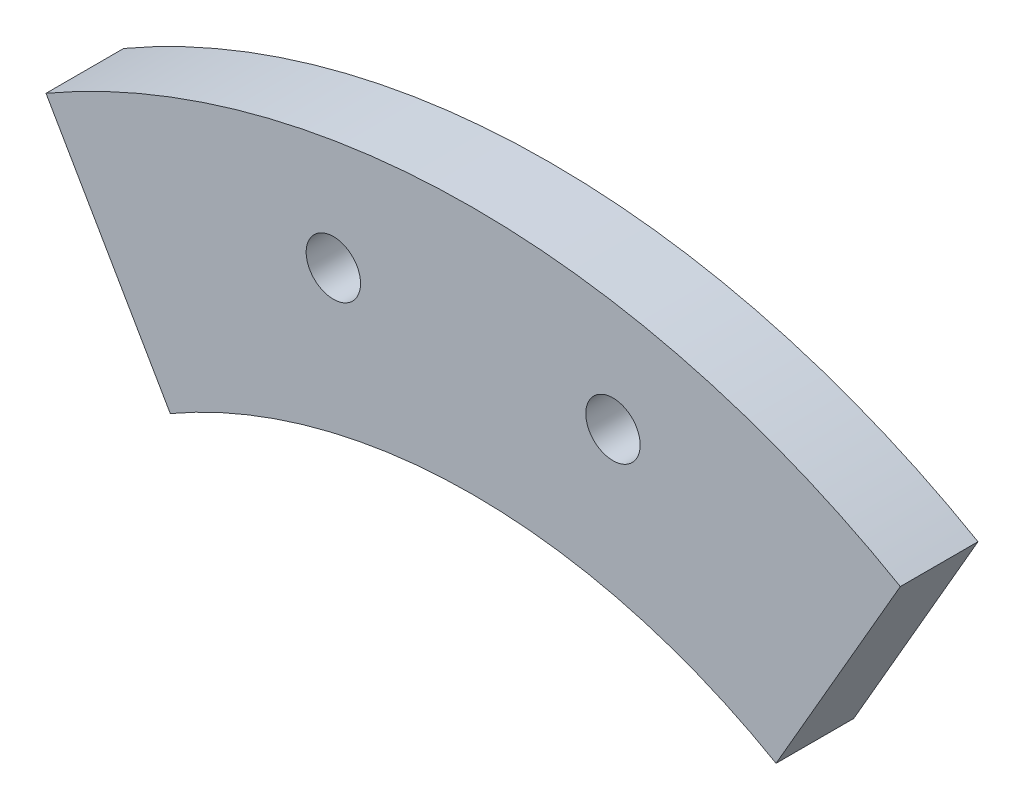
ISO-10303-21;
HEADER;
FILE_DESCRIPTION(('STEP AP214'),'2;1');
FILE_NAME('part.step','',(''),(''),'','','');
FILE_SCHEMA(('AUTOMOTIVE_DESIGN { 1 0 10303 214 1 1 1 1 }'));
ENDSEC;
DATA;
#1=APPLICATION_CONTEXT('core data for automotive mechanical design processes');
#2=APPLICATION_PROTOCOL_DEFINITION('international standard','automotive_design',2000,#1);
#3=PRODUCT_CONTEXT('',#1,'mechanical');
#4=PRODUCT('Part','Part','',(#3));
#5=PRODUCT_RELATED_PRODUCT_CATEGORY('part','',(#4));
#6=PRODUCT_DEFINITION_FORMATION('','',#4);
#7=PRODUCT_DEFINITION_CONTEXT('part definition',#1,'design');
#8=PRODUCT_DEFINITION('design','',#6,#7);
#9=PRODUCT_DEFINITION_SHAPE('','',#8);
#10=(LENGTH_UNIT() NAMED_UNIT(*) SI_UNIT(.MILLI.,.METRE.));
#11=(NAMED_UNIT(*) PLANE_ANGLE_UNIT() SI_UNIT($,.RADIAN.));
#12=(NAMED_UNIT(*) SI_UNIT($,.STERADIAN.) SOLID_ANGLE_UNIT());
#13=UNCERTAINTY_MEASURE_WITH_UNIT(LENGTH_MEASURE(1.E-05),#10,'distance_accuracy_value','');
#14=(GEOMETRIC_REPRESENTATION_CONTEXT(3) GLOBAL_UNCERTAINTY_ASSIGNED_CONTEXT((#13)) GLOBAL_UNIT_ASSIGNED_CONTEXT((#10,
#11,#12)) REPRESENTATION_CONTEXT('',''));
#15=CARTESIAN_POINT('',(0.,0.,0.));
#16=DIRECTION('',(0.,0.,1.));
#17=DIRECTION('',(1.,0.,0.));
#18=AXIS2_PLACEMENT_3D('',#15,#16,#17);
#19=CARTESIAN_POINT('',(0.,0.,5.));
#20=DIRECTION('',(-0.866025403784438,0.500000000000001,0.));
#21=DIRECTION('',(-0.500000000000001,-0.866025403784438,0.));
#22=AXIS2_PLACEMENT_3D('',#19,#20,#21);
#23=PLANE('',#22);
#24=DIRECTION('',(0.500000000000001,0.866025403784438,0.));
#25=VECTOR('',#24,1.);
#26=CARTESIAN_POINT('',(0.,0.,5.));
#27=LINE('',#26,#25);
#28=CARTESIAN_POINT('',(19.5,33.7749907475931,5.));
#29=VERTEX_POINT('',#28);
#30=CARTESIAN_POINT('',(27.5000000000001,47.6313972081441,5.));
#31=VERTEX_POINT('',#30);
#32=EDGE_CURVE('E111',#29,#31,#27,.T.);
#33=ORIENTED_EDGE('',*,*,#32,.F.);
#34=DIRECTION('',(0.,0.,-1.));
#35=VECTOR('',#34,1.);
#36=CARTESIAN_POINT('',(19.5,33.7749907475931,5.));
#37=LINE('',#36,#35);
#38=CARTESIAN_POINT('',(19.5,33.7749907475931,0.));
#39=VERTEX_POINT('',#38);
#40=EDGE_CURVE('E107',#29,#39,#37,.T.);
#41=ORIENTED_EDGE('',*,*,#40,.T.);
#42=DIRECTION('',(0.500000000000001,0.866025403784438,0.));
#43=VECTOR('',#42,1.);
#44=CARTESIAN_POINT('',(0.,0.,0.));
#45=LINE('',#44,#43);
#46=CARTESIAN_POINT('',(27.5000000000001,47.6313972081441,0.));
#47=VERTEX_POINT('',#46);
#48=EDGE_CURVE('E97',#39,#47,#45,.T.);
#49=ORIENTED_EDGE('',*,*,#48,.T.);
#50=DIRECTION('',(0.,0.,-1.));
#51=VECTOR('',#50,1.);
#52=CARTESIAN_POINT('',(27.5000000000001,47.6313972081441,5.));
#53=LINE('',#52,#51);
#54=EDGE_CURVE('E13',#31,#47,#53,.T.);
#55=ORIENTED_EDGE('',*,*,#54,.F.);
#56=EDGE_LOOP('',(#33,#41,#49,#55));
#57=FACE_BOUND('',#56,.T.);
#58=ADVANCED_FACE('F46',(#57),#23,.F.);
#59=CARTESIAN_POINT('',(0.,0.,5.));
#60=DIRECTION('',(0.,0.,-1.));
#61=DIRECTION('',(-1.,0.,0.));
#62=AXIS2_PLACEMENT_3D('',#59,#60,#61);
#63=CYLINDRICAL_SURFACE('',#62,55.);
#64=CARTESIAN_POINT('',(0.,0.,0.));
#65=DIRECTION('',(0.,0.,1.));
#66=DIRECTION('',(1.,0.,0.));
#67=AXIS2_PLACEMENT_3D('',#64,#65,#66);
#68=CIRCLE('',#67,55.);
#69=CARTESIAN_POINT('',(-27.5000000000001,47.6313972081441,0.));
#70=VERTEX_POINT('',#69);
#71=EDGE_CURVE('E87',#47,#70,#68,.T.);
#72=ORIENTED_EDGE('',*,*,#71,.T.);
#73=DIRECTION('',(0.,0.,-1.));
#74=VECTOR('',#73,1.);
#75=CARTESIAN_POINT('',(-27.5000000000001,47.6313972081441,5.));
#76=LINE('',#75,#74);
#77=CARTESIAN_POINT('',(-27.5000000000001,47.6313972081441,5.));
#78=VERTEX_POINT('',#77);
#79=EDGE_CURVE('E54',#78,#70,#76,.T.);
#80=ORIENTED_EDGE('',*,*,#79,.F.);
#81=CARTESIAN_POINT('',(0.,0.,5.));
#82=DIRECTION('',(0.,0.,1.));
#83=DIRECTION('',(1.,0.,0.));
#84=AXIS2_PLACEMENT_3D('',#81,#82,#83);
#85=CIRCLE('',#84,55.);
#86=EDGE_CURVE('E109',#31,#78,#85,.T.);
#87=ORIENTED_EDGE('',*,*,#86,.F.);
#88=ORIENTED_EDGE('',*,*,#54,.T.);
#89=EDGE_LOOP('',(#72,#80,#87,#88));
#90=FACE_BOUND('',#89,.T.);
#91=ADVANCED_FACE('F95',(#90),#63,.T.);
#92=CARTESIAN_POINT('',(-9.,47.1487009365051,5.));
#93=DIRECTION('',(0.,0.,-1.));
#94=DIRECTION('',(-1.,0.,0.));
#95=AXIS2_PLACEMENT_3D('',#92,#93,#94);
#96=CYLINDRICAL_SURFACE('',#95,1.75);
#97=CARTESIAN_POINT('',(-9.,47.1487009365051,5.));
#98=DIRECTION('',(0.,0.,1.));
#99=DIRECTION('',(1.,0.,0.));
#100=AXIS2_PLACEMENT_3D('',#97,#98,#99);
#101=CIRCLE('',#100,1.75);
#102=CARTESIAN_POINT('',(-7.25,47.1487009365051,5.));
#103=VERTEX_POINT('',#102);
#104=EDGE_CURVE('E113',#103,#103,#101,.T.);
#105=ORIENTED_EDGE('',*,*,#104,.T.);
#106=EDGE_LOOP('',(#105));
#107=FACE_BOUND('',#106,.T.);
#108=CARTESIAN_POINT('',(-9.,47.1487009365051,0.));
#109=DIRECTION('',(0.,0.,1.));
#110=DIRECTION('',(1.,0.,0.));
#111=AXIS2_PLACEMENT_3D('',#108,#109,#110);
#112=CIRCLE('',#111,1.75);
#113=CARTESIAN_POINT('',(-7.25,47.1487009365051,0.));
#114=VERTEX_POINT('',#113);
#115=EDGE_CURVE('E99',#114,#114,#112,.T.);
#116=ORIENTED_EDGE('',*,*,#115,.F.);
#117=EDGE_LOOP('',(#116));
#118=FACE_BOUND('',#117,.T.);
#119=ADVANCED_FACE('F148',(#107,#118),#96,.F.);
#120=CARTESIAN_POINT('',(9.,47.1487009365051,5.));
#121=DIRECTION('',(0.,0.,-1.));
#122=DIRECTION('',(-1.,0.,0.));
#123=AXIS2_PLACEMENT_3D('',#120,#121,#122);
#124=CYLINDRICAL_SURFACE('',#123,1.75);
#125=CARTESIAN_POINT('',(9.,47.1487009365051,5.));
#126=DIRECTION('',(0.,0.,1.));
#127=DIRECTION('',(1.,0.,0.));
#128=AXIS2_PLACEMENT_3D('',#125,#126,#127);
#129=CIRCLE('',#128,1.75);
#130=CARTESIAN_POINT('',(10.75,47.1487009365051,5.));
#131=VERTEX_POINT('',#130);
#132=EDGE_CURVE('E89',#131,#131,#129,.T.);
#133=ORIENTED_EDGE('',*,*,#132,.T.);
#134=EDGE_LOOP('',(#133));
#135=FACE_BOUND('',#134,.T.);
#136=CARTESIAN_POINT('',(9.,47.1487009365051,0.));
#137=DIRECTION('',(0.,0.,1.));
#138=DIRECTION('',(1.,0.,0.));
#139=AXIS2_PLACEMENT_3D('',#136,#137,#138);
#140=CIRCLE('',#139,1.75);
#141=CARTESIAN_POINT('',(10.75,47.1487009365051,0.));
#142=VERTEX_POINT('',#141);
#143=EDGE_CURVE('E104',#142,#142,#140,.T.);
#144=ORIENTED_EDGE('',*,*,#143,.F.);
#145=EDGE_LOOP('',(#144));
#146=FACE_BOUND('',#145,.T.);
#147=ADVANCED_FACE('F48',(#135,#146),#124,.F.);
#148=CARTESIAN_POINT('',(0.,0.,5.));
#149=DIRECTION('',(-0.866025403784438,-0.500000000000001,0.));
#150=DIRECTION('',(0.500000000000001,-0.866025403784438,0.));
#151=AXIS2_PLACEMENT_3D('',#148,#149,#150);
#152=PLANE('',#151);
#153=DIRECTION('',(0.,0.,-1.));
#154=VECTOR('',#153,1.);
#155=CARTESIAN_POINT('',(-19.5000000000001,33.7749907475931,5.));
#156=LINE('',#155,#154);
#157=CARTESIAN_POINT('',(-19.5,33.7749907475931,5.));
#158=VERTEX_POINT('',#157);
#159=CARTESIAN_POINT('',(-19.5,33.7749907475931,0.));
#160=VERTEX_POINT('',#159);
#161=EDGE_CURVE('E61',#158,#160,#156,.T.);
#162=ORIENTED_EDGE('',*,*,#161,.F.);
#163=DIRECTION('',(-0.500000000000001,0.866025403784438,0.));
#164=VECTOR('',#163,1.);
#165=CARTESIAN_POINT('',(0.,0.,5.));
#166=LINE('',#165,#164);
#167=EDGE_CURVE('E69',#158,#78,#166,.T.);
#168=ORIENTED_EDGE('',*,*,#167,.T.);
#169=ORIENTED_EDGE('',*,*,#79,.T.);
#170=DIRECTION('',(-0.500000000000001,0.866025403784438,0.));
#171=VECTOR('',#170,1.);
#172=CARTESIAN_POINT('',(0.,0.,0.));
#173=LINE('',#172,#171);
#174=EDGE_CURVE('E83',#160,#70,#173,.T.);
#175=ORIENTED_EDGE('',*,*,#174,.F.);
#176=EDGE_LOOP('',(#162,#168,#169,#175));
#177=FACE_BOUND('',#176,.T.);
#178=ADVANCED_FACE('F92',(#177),#152,.T.);
#179=CARTESIAN_POINT('',(0.,0.,5.));
#180=DIRECTION('',(0.,0.,1.));
#181=DIRECTION('',(1.,0.,0.));
#182=AXIS2_PLACEMENT_3D('',#179,#180,#181);
#183=PLANE('',#182);
#184=CARTESIAN_POINT('',(0.,0.,5.));
#185=DIRECTION('',(0.,0.,-1.));
#186=DIRECTION('',(-1.,0.,0.));
#187=AXIS2_PLACEMENT_3D('',#184,#185,#186);
#188=CIRCLE('',#187,39.);
#189=EDGE_CURVE('E121',#158,#29,#188,.T.);
#190=ORIENTED_EDGE('',*,*,#189,.T.);
#191=ORIENTED_EDGE('',*,*,#32,.T.);
#192=ORIENTED_EDGE('',*,*,#86,.T.);
#193=ORIENTED_EDGE('',*,*,#167,.F.);
#194=EDGE_LOOP('',(#190,#191,#192,#193));
#195=FACE_BOUND('',#194,.T.);
#196=ORIENTED_EDGE('',*,*,#132,.F.);
#197=EDGE_LOOP('',(#196));
#198=FACE_BOUND('',#197,.T.);
#199=ORIENTED_EDGE('',*,*,#104,.F.);
#200=EDGE_LOOP('',(#199));
#201=FACE_BOUND('',#200,.T.);
#202=ADVANCED_FACE('F127',(#195,#198,#201),#183,.T.);
#203=CARTESIAN_POINT('',(0.,0.,0.));
#204=DIRECTION('',(0.,0.,1.));
#205=DIRECTION('',(1.,0.,0.));
#206=AXIS2_PLACEMENT_3D('',#203,#204,#205);
#207=PLANE('',#206);
#208=ORIENTED_EDGE('',*,*,#143,.T.);
#209=EDGE_LOOP('',(#208));
#210=FACE_BOUND('',#209,.T.);
#211=ORIENTED_EDGE('',*,*,#115,.T.);
#212=EDGE_LOOP('',(#211));
#213=FACE_BOUND('',#212,.T.);
#214=ORIENTED_EDGE('',*,*,#48,.F.);
#215=CARTESIAN_POINT('',(0.,0.,0.));
#216=DIRECTION('',(0.,0.,-1.));
#217=DIRECTION('',(-1.,0.,0.));
#218=AXIS2_PLACEMENT_3D('',#215,#216,#217);
#219=CIRCLE('',#218,39.);
#220=EDGE_CURVE('E88',#160,#39,#219,.T.);
#221=ORIENTED_EDGE('',*,*,#220,.F.);
#222=ORIENTED_EDGE('',*,*,#174,.T.);
#223=ORIENTED_EDGE('',*,*,#71,.F.);
#224=EDGE_LOOP('',(#214,#221,#222,#223));
#225=FACE_BOUND('',#224,.T.);
#226=ADVANCED_FACE('F85',(#210,#213,#225),#207,.F.);
#227=CARTESIAN_POINT('',(0.,0.,5.));
#228=DIRECTION('',(0.,0.,-1.));
#229=DIRECTION('',(-1.,0.,0.));
#230=AXIS2_PLACEMENT_3D('',#227,#228,#229);
#231=CYLINDRICAL_SURFACE('',#230,39.);
#232=ORIENTED_EDGE('',*,*,#189,.F.);
#233=ORIENTED_EDGE('',*,*,#161,.T.);
#234=ORIENTED_EDGE('',*,*,#220,.T.);
#235=ORIENTED_EDGE('',*,*,#40,.F.);
#236=EDGE_LOOP('',(#232,#233,#234,#235));
#237=FACE_BOUND('',#236,.T.);
#238=ADVANCED_FACE('F134',(#237),#231,.F.);
#239=CLOSED_SHELL('',(#58,#91,#119,#147,#178,#202,#226,#238));
#240=MANIFOLD_SOLID_BREP('B2',#239);
#241=ADVANCED_BREP_SHAPE_REPRESENTATION('',(#18,#240),#14);
#242=SHAPE_DEFINITION_REPRESENTATION(#9,#241);
ENDSEC;
END-ISO-10303-21;
